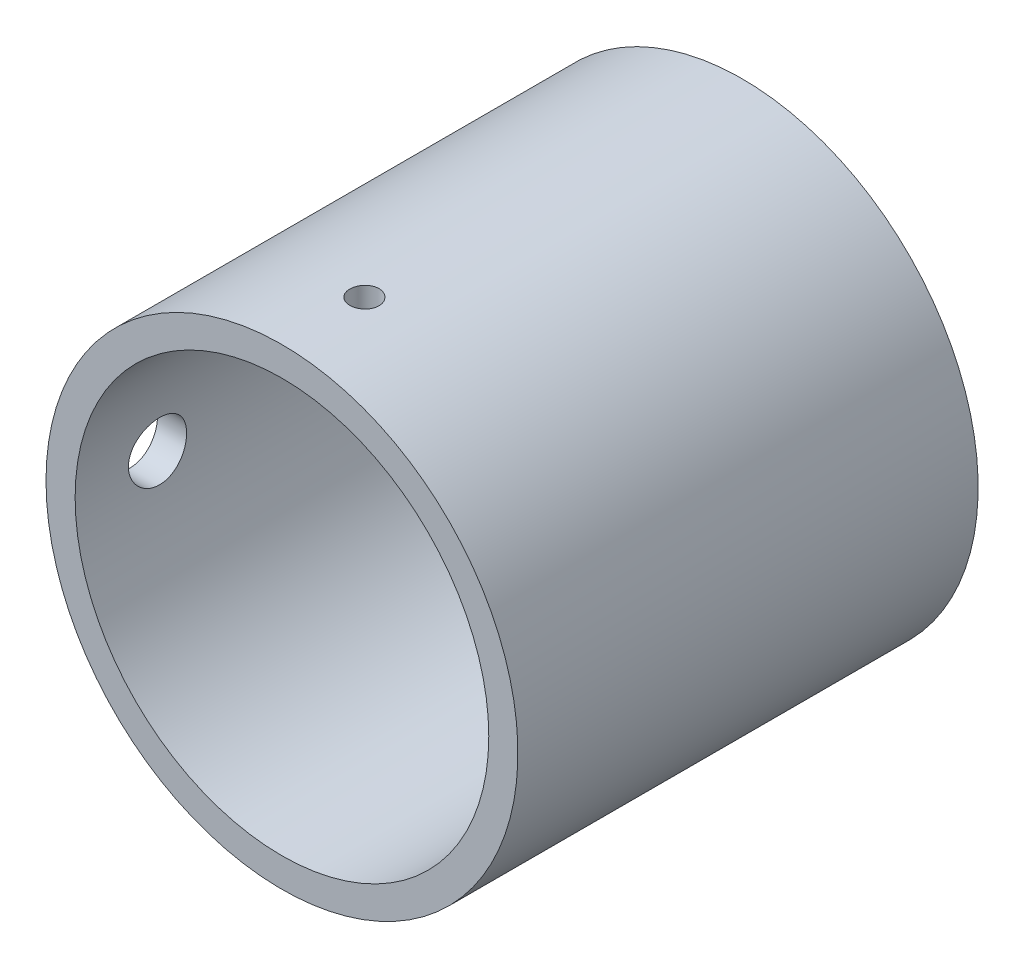
ISO-10303-21;
HEADER;
FILE_DESCRIPTION(('STEP AP214'),'2;1');
FILE_NAME('part.step','',(''),(''),'','','');
FILE_SCHEMA(('AUTOMOTIVE_DESIGN { 1 0 10303 214 1 1 1 1 }'));
ENDSEC;
DATA;
#1=APPLICATION_CONTEXT('core data for automotive mechanical design processes');
#2=APPLICATION_PROTOCOL_DEFINITION('international standard','automotive_design',2000,#1);
#3=PRODUCT_CONTEXT('',#1,'mechanical');
#4=PRODUCT('Part','Part','',(#3));
#5=PRODUCT_RELATED_PRODUCT_CATEGORY('part','',(#4));
#6=PRODUCT_DEFINITION_FORMATION('','',#4);
#7=PRODUCT_DEFINITION_CONTEXT('part definition',#1,'design');
#8=PRODUCT_DEFINITION('design','',#6,#7);
#9=PRODUCT_DEFINITION_SHAPE('','',#8);
#10=(LENGTH_UNIT() NAMED_UNIT(*) SI_UNIT(.MILLI.,.METRE.));
#11=(NAMED_UNIT(*) PLANE_ANGLE_UNIT() SI_UNIT($,.RADIAN.));
#12=(NAMED_UNIT(*) SI_UNIT($,.STERADIAN.) SOLID_ANGLE_UNIT());
#13=UNCERTAINTY_MEASURE_WITH_UNIT(LENGTH_MEASURE(1.E-05),#10,'distance_accuracy_value','');
#14=(GEOMETRIC_REPRESENTATION_CONTEXT(3) GLOBAL_UNCERTAINTY_ASSIGNED_CONTEXT((#13)) GLOBAL_UNIT_ASSIGNED_CONTEXT((#10,
#11,#12)) REPRESENTATION_CONTEXT('',''));
#15=CARTESIAN_POINT('',(0.,0.,0.));
#16=DIRECTION('',(0.,0.,1.));
#17=DIRECTION('',(1.,0.,0.));
#18=AXIS2_PLACEMENT_3D('',#15,#16,#17);
#19=CARTESIAN_POINT('',(0.,0.,24.2977597104441));
#20=DIRECTION('',(0.,0.,-1.));
#21=DIRECTION('',(-1.,0.,0.));
#22=AXIS2_PLACEMENT_3D('',#19,#20,#21);
#23=CYLINDRICAL_SURFACE('',#22,8.1);
#24=CARTESIAN_POINT('',(-8.1,0.,-2.44065146761932));
#25=CARTESIAN_POINT('',(-8.09999922741937,0.05594214674333,-2.44064908756269));
#26=CARTESIAN_POINT('',(-8.09941433539592,0.111919389029058,-2.43594135609883));
#27=CARTESIAN_POINT('',(-8.09713734435104,0.222316609962162,-2.4172353852108));
#28=CARTESIAN_POINT('',(-8.09544408491826,0.276734894056091,-2.40322740862416));
#29=CARTESIAN_POINT('',(-8.09114114001845,0.382399960320262,-2.36633960947191));
#30=CARTESIAN_POINT('',(-8.08853206722158,0.433648835900763,-2.34346571705327));
#31=CARTESIAN_POINT('',(-8.08268778329365,0.531570592610797,-2.28950826455301));
#32=CARTESIAN_POINT('',(-8.07945268075372,0.578244265242838,-2.25842612793311));
#33=CARTESIAN_POINT('',(-8.07269816886397,0.665951461581989,-2.18875581391666));
#34=CARTESIAN_POINT('',(-8.06917746991779,0.706956850183508,-2.15013233901277));
#35=CARTESIAN_POINT('',(-8.06225898575994,0.781921210575562,-2.06655148578826));
#36=CARTESIAN_POINT('',(-8.05886120677906,0.815879825579885,-2.02159378695202));
#37=CARTESIAN_POINT('',(-8.05256054888837,0.875891152826882,-1.92643825588324));
#38=CARTESIAN_POINT('',(-8.04965933020587,0.901917562075163,-1.87622371585767));
#39=CARTESIAN_POINT('',(-8.04469722578763,0.945157707766813,-1.77209483040872));
#40=CARTESIAN_POINT('',(-8.04263630895148,0.962371770370088,-1.71818062200013));
#41=CARTESIAN_POINT('',(-8.03960042916579,0.987413214267985,-1.60847452967584));
#42=CARTESIAN_POINT('',(-8.03861997779846,0.995288051534377,-1.55269363255189));
#43=CARTESIAN_POINT('',(-8.03783922780068,1.00157434170351,-1.4405940449087));
#44=CARTESIAN_POINT('',(-8.0380388828369,0.999986166143075,-1.38427537559016));
#45=CARTESIAN_POINT('',(-8.03959076494516,0.987430479432359,-1.27302940835726));
#46=CARTESIAN_POINT('',(-8.04093657197875,0.976515211775962,-1.21809611174435));
#47=CARTESIAN_POINT('',(-8.04461910501935,0.945696682628199,-1.11084694712858));
#48=CARTESIAN_POINT('',(-8.0469558506526,0.925793243119296,-1.05853113098968));
#49=CARTESIAN_POINT('',(-8.05236425496116,0.877507099359364,-0.957839495876907));
#50=CARTESIAN_POINT('',(-8.0554378796733,0.849101660023145,-0.90947468930058));
#51=CARTESIAN_POINT('',(-8.06197219236468,0.784634111746423,-0.818178633591746));
#52=CARTESIAN_POINT('',(-8.06543289761236,0.74857166114684,-0.775247627054173));
#53=CARTESIAN_POINT('',(-8.07237998032577,0.669524082283407,-0.695734563804384));
#54=CARTESIAN_POINT('',(-8.07586637355702,0.626493916933986,-0.659197266992361));
#55=CARTESIAN_POINT('',(-8.08245015770334,0.534887535004503,-0.593857185030782));
#56=CARTESIAN_POINT('',(-8.08554754775847,0.486311306164644,-0.565054416979187));
#57=CARTESIAN_POINT('',(-8.09100618930941,0.384957418193104,-0.5160010879987));
#58=CARTESIAN_POINT('',(-8.09336720261287,0.332178406522372,-0.49575329355778));
#59=CARTESIAN_POINT('',(-8.09708489187725,0.223933971213345,-0.464420019984365));
#60=CARTESIAN_POINT('',(-8.09844161369651,0.16846867036063,-0.453334122495202));
#61=CARTESIAN_POINT('',(-8.09999189798397,0.0568131699425717,-0.440697259566245));
#62=CARTESIAN_POINT('',(-8.1001929828885,0.00063004990717188,-0.439084627867787));
#63=CARTESIAN_POINT('',(-8.09942963731472,-0.111205648519718,-0.445277387614855));
#64=CARTESIAN_POINT('',(-8.09846523103467,-0.166858237902063,-0.453082583524671));
#65=CARTESIAN_POINT('',(-8.09548396217872,-0.275871415079483,-0.477838213514454));
#66=CARTESIAN_POINT('',(-8.09347047993864,-0.329238772151461,-0.49475928032227));
#67=CARTESIAN_POINT('',(-8.08861651404656,-0.432378270660616,-0.537235816800683));
#68=CARTESIAN_POINT('',(-8.08577600294323,-0.482150292690405,-0.562791573084594));
#69=CARTESIAN_POINT('',(-8.07956598002017,-0.576961912205817,-0.621961505417251));
#70=CARTESIAN_POINT('',(-8.07619387631939,-0.621976416252225,-0.655615613552801));
#71=CARTESIAN_POINT('',(-8.06930608952946,-0.705739989694125,-0.729970388105632));
#72=CARTESIAN_POINT('',(-8.06579040089,-0.744488816600736,-0.770671327117169));
#73=CARTESIAN_POINT('',(-8.05898851395506,-0.814839572602706,-0.858235876435112));
#74=CARTESIAN_POINT('',(-8.05570369730784,-0.846400651747522,-0.905132429173627));
#75=CARTESIAN_POINT('',(-8.04975808813212,-0.901197895148184,-1.00359695157376));
#76=CARTESIAN_POINT('',(-8.04709728335408,-0.924434222825896,-1.05516482950843));
#77=CARTESIAN_POINT('',(-8.04271032507821,-0.961856081742296,-1.16137581097466));
#78=CARTESIAN_POINT('',(-8.04098178598848,-0.976064730842429,-1.21601066654093));
#79=CARTESIAN_POINT('',(-8.0386481910181,-0.995102387633879,-1.32691350005761));
#80=CARTESIAN_POINT('',(-8.03804308425747,-0.999931820107978,-1.38318140393046));
#81=CARTESIAN_POINT('',(-8.03802632219156,-1.0000662905441,-1.49534672015459));
#82=CARTESIAN_POINT('',(-8.03860662533402,-0.995435504469667,-1.55124406523553));
#83=CARTESIAN_POINT('',(-8.04087801825031,-0.976916797222831,-1.66145953084864));
#84=CARTESIAN_POINT('',(-8.04256910823268,-0.963028874312646,-1.71577765108435));
#85=CARTESIAN_POINT('',(-8.04686906175994,-0.926410030686894,-1.82128486242415));
#86=CARTESIAN_POINT('',(-8.04947761276383,-0.903682121110215,-1.87247501213688));
#87=CARTESIAN_POINT('',(-8.05531909495582,-0.85003479092611,-1.97032518905899));
#88=CARTESIAN_POINT('',(-8.05855203320764,-0.819115277645245,-2.01698516500935));
#89=CARTESIAN_POINT('',(-8.06530429843633,-0.749724103367036,-2.10477862375658));
#90=CARTESIAN_POINT('',(-8.06882535219166,-0.711204605816081,-2.14587416669033));
#91=CARTESIAN_POINT('',(-8.07574182689939,-0.627806446454244,-2.22104291828186));
#92=CARTESIAN_POINT('',(-8.07913721800535,-0.582926285977472,-2.25511446732602));
#93=CARTESIAN_POINT('',(-8.08543367524378,-0.487890157300051,-2.31537531255576));
#94=CARTESIAN_POINT('',(-8.08833285956033,-0.437715222782328,-2.34153487883446));
#95=CARTESIAN_POINT('',(-8.09329109884716,-0.333677085780852,-2.38501977836541));
#96=CARTESIAN_POINT('',(-8.09535106854533,-0.279817974196701,-2.40235473544629));
#97=CARTESIAN_POINT('',(-8.09790076769708,-0.188065338859439,-2.42353711493137));
#98=CARTESIAN_POINT('',(-8.09868415585033,-0.150750974329778,-2.42994580448819));
#99=CARTESIAN_POINT('',(-8.09973403133313,-0.07562975183004,-2.43850377023727));
#100=CARTESIAN_POINT('',(-8.10000052234745,-0.0378228973726809,-2.44065307679313));
#101=CARTESIAN_POINT('',(-8.1,0.,-2.44065146761932));
#102=B_SPLINE_CURVE_WITH_KNOTS('',3,(#24,#25,#26,#27,#28,#29,#30,#31,#32,#33,#34,#35,#36,#37,
#38,#39,#40,#41,#42,#43,#44,#45,#46,#47,#48,#49,#50,#51,#52,#53,#54,#55,#56,#57,#58,#59,#60,#61,
#62,#63,#64,#65,#66,#67,#68,#69,#70,#71,#72,#73,#74,#75,#76,#77,#78,#79,#80,#81,#82,#83,#84,#85,
#86,#87,#88,#89,#90,#91,#92,#93,#94,#95,#96,#97,#98,#99,#100,#101),.UNSPECIFIED.,.T.,.F.,(4,2,2,
2,2,2,2,2,2,2,2,2,2,2,2,2,2,2,2,2,2,2,2,2,2,2,2,2,2,2,2,2,2,2,2,2,2,2,4),(0.,0.167688287858711,
0.33555241929854,0.503304464642079,0.671027437753083,0.839555123803084,1.00809134052191,
1.1771804865068,1.34626337376285,1.51448335758694,1.6826967368014,1.84997403887081,
2.01725465413889,2.18498665065476,2.35272613301662,2.52159660867717,2.69046745763993,
2.85939287395638,3.02831057626121,3.19612747897657,3.36394089748794,3.53121690088544,
3.69849845726089,3.86662240092383,4.03475284961943,4.2038162249713,4.37287628128515,
4.54150164904549,4.71011937961965,4.87759704487774,5.04507474157534,5.21249544072306,
5.37991803401936,5.54843013729207,5.7169820107102,5.88615958005681,6.05515225251731,
6.16852834701992,6.28190363330239),.UNSPECIFIED.);
#103=CARTESIAN_POINT('',(-8.1,0.,-2.44065146761932));
#104=VERTEX_POINT('',#103);
#105=EDGE_CURVE('E55',#104,#104,#102,.T.);
#106=ORIENTED_EDGE('',*,*,#105,.T.);
#107=EDGE_LOOP('',(#106));
#108=FACE_BOUND('',#107,.T.);
#109=CARTESIAN_POINT('',(0.,0.,1.3875));
#110=DIRECTION('',(0.,0.,-1.));
#111=DIRECTION('',(-1.,0.,0.));
#112=AXIS2_PLACEMENT_3D('',#109,#110,#111);
#113=CIRCLE('',#112,8.1);
#114=CARTESIAN_POINT('',(-8.1,0.,1.3875));
#115=VERTEX_POINT('',#114);
#116=EDGE_CURVE('E42',#115,#115,#113,.T.);
#117=ORIENTED_EDGE('',*,*,#116,.T.);
#118=EDGE_LOOP('',(#117));
#119=FACE_BOUND('',#118,.T.);
#120=CARTESIAN_POINT('',(0.,0.,-14.4125));
#121=DIRECTION('',(0.,0.,-1.));
#122=DIRECTION('',(-1.,0.,0.));
#123=AXIS2_PLACEMENT_3D('',#120,#121,#122);
#124=CIRCLE('',#123,8.1);
#125=CARTESIAN_POINT('',(-8.1,0.,-14.4125));
#126=VERTEX_POINT('',#125);
#127=EDGE_CURVE('E75',#126,#126,#124,.F.);
#128=ORIENTED_EDGE('',*,*,#127,.T.);
#129=EDGE_LOOP('',(#128));
#130=FACE_BOUND('',#129,.T.);
#131=CARTESIAN_POINT('',(0.,8.1,-1.94065146761932));
#132=CARTESIAN_POINT('',(-0.0280565566641799,8.09999979475951,-1.94065023286848));
#133=CARTESIAN_POINT('',(-0.0561327755197097,8.09985266860309,-1.93828202141509));
#134=CARTESIAN_POINT('',(-0.111510014560206,8.09927989768484,-1.92886872051376));
#135=CARTESIAN_POINT('',(-0.138810093050403,8.09885392848884,-1.92181818303551));
#136=CARTESIAN_POINT('',(-0.191824890167446,8.09777166167511,-1.90324346524688));
#137=CARTESIAN_POINT('',(-0.217540434907588,8.09711548529349,-1.89172163935342));
#138=CARTESIAN_POINT('',(-0.266665768702005,8.09564661238466,-1.86453521030765));
#139=CARTESIAN_POINT('',(-0.290076085231352,8.09483395179005,-1.8488715579122));
#140=CARTESIAN_POINT('',(-0.333967453964497,8.0931421312236,-1.81382094878486));
#141=CARTESIAN_POINT('',(-0.354444686586807,8.09226288677956,-1.79442921274847));
#142=CARTESIAN_POINT('',(-0.391855956922008,8.09053771603672,-1.75248272896546));
#143=CARTESIAN_POINT('',(-0.408789846806787,8.0896917911292,-1.72992784931815));
#144=CARTESIAN_POINT('',(-0.438645445261879,8.08812800720108,-1.6822737826753));
#145=CARTESIAN_POINT('',(-0.451563990546774,8.08741024933882,-1.65717261025487));
#146=CARTESIAN_POINT('',(-0.473001945608588,8.08618483124309,-1.60515241056613));
#147=CARTESIAN_POINT('',(-0.481521401743706,8.08567716879561,-1.57823340245778));
#148=CARTESIAN_POINT('',(-0.493908767333535,8.08492999309712,-1.52337837637618));
#149=CARTESIAN_POINT('',(-0.497782646667117,8.08469013572597,-1.49544371128403));
#150=CARTESIAN_POINT('',(-0.500787321684715,8.084504588182,-1.43931966078546));
#151=CARTESIAN_POINT('',(-0.49991816997583,8.08455889474648,-1.41113027820771));
#152=CARTESIAN_POINT('',(-0.493466410334094,8.0849552314194,-1.35533765781664));
#153=CARTESIAN_POINT('',(-0.487890262046566,8.08529686720932,-1.32773366983118));
#154=CARTESIAN_POINT('',(-0.472192814373869,8.08622874070708,-1.27385425620842));
#155=CARTESIAN_POINT('',(-0.462071488300757,8.08681897987466,-1.24757883837311));
#156=CARTESIAN_POINT('',(-0.437563656276238,8.0881819971168,-1.19708167219224));
#157=CARTESIAN_POINT('',(-0.423174219049295,8.08895490056812,-1.17286135000626));
#158=CARTESIAN_POINT('',(-0.390540753214269,8.09059601855954,-1.12717749386382));
#159=CARTESIAN_POINT('',(-0.37229668237031,8.09146423414394,-1.10571399011843));
#160=CARTESIAN_POINT('',(-0.332435444853554,8.09319988429787,-1.06611545652141));
#161=CARTESIAN_POINT('',(-0.310812687486245,8.09406731513228,-1.04798605381238));
#162=CARTESIAN_POINT('',(-0.264827470445837,8.09570224496201,-1.01561375157049));
#163=CARTESIAN_POINT('',(-0.240465009837291,8.09646974392321,-1.00137085336465));
#164=CARTESIAN_POINT('',(-0.189688542997121,8.09781838247837,-0.977176344708798));
#165=CARTESIAN_POINT('',(-0.16327443549842,8.09839951286611,-0.967224946241626));
#166=CARTESIAN_POINT('',(-0.109145995053428,8.09930980385897,-0.951899674432392));
#167=CARTESIAN_POINT('',(-0.0814316769240631,8.09963896733471,-0.946525748939777));
#168=CARTESIAN_POINT('',(-0.0255383483360696,8.10000786265556,-0.940514939294613));
#169=CARTESIAN_POINT('',(0.00263982242915681,8.10004806986963,-0.939870274883377));
#170=CARTESIAN_POINT('',(0.0587039040170475,8.09983578611,-0.943315960151445));
#171=CARTESIAN_POINT('',(0.0865898163220379,8.09958329662156,-0.947406285803284));
#172=CARTESIAN_POINT('',(0.141255891995393,8.09881435045943,-0.960199399952844));
#173=CARTESIAN_POINT('',(0.168036893567836,8.09829809801379,-0.968898620038975));
#174=CARTESIAN_POINT('',(0.219758800624205,8.09705970907877,-0.990658960144144));
#175=CARTESIAN_POINT('',(0.244699689958617,8.09633757078274,-1.00372011843963));
#176=CARTESIAN_POINT('',(0.292069026788101,8.09476737446074,-1.03385338975742));
#177=CARTESIAN_POINT('',(0.31449416248017,8.09391915379213,-1.05093070031509));
#178=CARTESIAN_POINT('',(0.356162088086153,8.09219280041411,-1.08860394659047));
#179=CARTESIAN_POINT('',(0.375404847411149,8.0913146674173,-1.10919991612557));
#180=CARTESIAN_POINT('',(0.410188132825381,8.08962608621206,-1.15335939626978));
#181=CARTESIAN_POINT('',(0.425723612344726,8.08881573123015,-1.17692688598242));
#182=CARTESIAN_POINT('',(0.452616824293819,8.08735557344742,-1.22634040480514));
#183=CARTESIAN_POINT('',(0.463974581973253,8.08670576967626,-1.25218642014289));
#184=CARTESIAN_POINT('',(0.482181202455226,8.08564066585356,-1.30540486563416));
#185=CARTESIAN_POINT('',(0.489033244367251,8.08522520048877,-1.33277620473763));
#186=CARTESIAN_POINT('',(0.498044312809468,8.08467516709001,-1.38828349002455));
#187=CARTESIAN_POINT('',(0.500203384554458,8.08454059634974,-1.41641942883875));
#188=CARTESIAN_POINT('',(0.49976678949514,8.08456759337792,-1.47260705323665));
#189=CARTESIAN_POINT('',(0.497179057019691,8.08472866697429,-1.50065880105506));
#190=CARTESIAN_POINT('',(0.487338756369365,8.08532775457875,-1.55592868889291));
#191=CARTESIAN_POINT('',(0.480086179708956,8.08576576909061,-1.58314682739589));
#192=CARTESIAN_POINT('',(0.461123839734222,8.08686925737638,-1.63597810135355));
#193=CARTESIAN_POINT('',(0.449414103182236,8.08753472978456,-1.66159124644409));
#194=CARTESIAN_POINT('',(0.421870948142214,8.08901812799941,-1.71048898995974));
#195=CARTESIAN_POINT('',(0.406037637807116,8.08983604980749,-1.73377364943411));
#196=CARTESIAN_POINT('',(0.370667503582555,8.09153376616774,-1.77739365640811));
#197=CARTESIAN_POINT('',(0.351124954995559,8.09241365501954,-1.79772435810112));
#198=CARTESIAN_POINT('',(0.308898560772043,8.09413535822541,-1.8348235163026));
#199=CARTESIAN_POINT('',(0.286213947451571,8.09497716320779,-1.85159109970844));
#200=CARTESIAN_POINT('',(0.238322079466912,8.09652869499997,-1.88110008918034));
#201=CARTESIAN_POINT('',(0.213111785864411,8.09723825968895,-1.89383656646368));
#202=CARTESIAN_POINT('',(0.160924584122798,8.09844316471261,-1.91488040631073));
#203=CARTESIAN_POINT('',(0.133949788071955,8.09893875595707,-1.92319295913859));
#204=CARTESIAN_POINT('',(0.0890081576534832,8.09952991866475,-1.93299114137644));
#205=CARTESIAN_POINT('',(0.0713318634904911,8.09970541632906,-1.93586005237701));
#206=CARTESIAN_POINT('',(0.0357730443091051,8.09994052235547,-1.93969060789058));
#207=CARTESIAN_POINT('',(0.0178905195681911,8.10000013087347,-1.94065225496947));
#208=CARTESIAN_POINT('',(0.,8.1,-1.94065146761932));
#209=B_SPLINE_CURVE_WITH_KNOTS('',3,(#131,#132,#133,#134,#135,#136,#137,#138,#139,#140,#141,
#142,#143,#144,#145,#146,#147,#148,#149,#150,#151,#152,#153,#154,#155,#156,#157,#158,#159,#160,
#161,#162,#163,#164,#165,#166,#167,#168,#169,#170,#171,#172,#173,#174,#175,#176,#177,#178,#179,
#180,#181,#182,#183,#184,#185,#186,#187,#188,#189,#190,#191,#192,#193,#194,#195,#196,#197,#198,
#199,#200,#201,#202,#203,#204,#205,#206,#207,#208),.UNSPECIFIED.,.T.,.F.,(4,2,2,2,2,2,2,2,2,2,2,
2,2,2,2,2,2,2,2,2,2,2,2,2,2,2,2,2,2,2,2,2,2,2,2,2,2,2,4),(0.,0.0841043592410772,
0.168306748341511,0.252464859573429,0.336603669044202,0.420851070302482,0.50510198565835,
0.589419106572033,0.673735338922315,0.75794310272926,0.842149932551775,0.926241388678948,
1.01033333857279,1.09448317582499,1.17863393516911,1.26292544237693,1.34721697836542,
1.43151267754038,1.51580741633258,1.59996344798957,1.68411905260295,1.76820959520941,
1.85230087573815,1.93650158842622,2.0207031104023,2.10501860688043,2.18933359375669,
2.27358902627484,2.35784364702364,2.44195756367534,2.52607163333395,2.61018519795037,
2.6942965566615,2.77853880104912,2.86280166432182,2.94716716025127,3.03143345694245,
3.08506344179977,3.13869335450726),.UNSPECIFIED.);
#210=CARTESIAN_POINT('',(0.,8.1,-1.94065146761932));
#211=VERTEX_POINT('',#210);
#212=EDGE_CURVE('E56',#211,#211,#209,.T.);
#213=ORIENTED_EDGE('',*,*,#212,.F.);
#214=EDGE_LOOP('',(#213));
#215=FACE_BOUND('',#214,.T.);
#216=ADVANCED_FACE('F31',(#108,#119,#130,#215),#23,.T.);
#217=CARTESIAN_POINT('',(0.,0.,24.2977597104441));
#218=DIRECTION('',(0.,0.,-1.));
#219=DIRECTION('',(-1.,0.,0.));
#220=AXIS2_PLACEMENT_3D('',#217,#218,#219);
#221=CYLINDRICAL_SURFACE('',#220,7.1);
#222=CARTESIAN_POINT('',(0.,0.,-14.4125));
#223=DIRECTION('',(0.,0.,-1.));
#224=DIRECTION('',(-1.,0.,0.));
#225=AXIS2_PLACEMENT_3D('',#222,#223,#224);
#226=CIRCLE('',#225,7.1);
#227=CARTESIAN_POINT('',(-7.1,0.,-14.4125));
#228=VERTEX_POINT('',#227);
#229=EDGE_CURVE('E47',#228,#228,#226,.F.);
#230=ORIENTED_EDGE('',*,*,#229,.F.);
#231=EDGE_LOOP('',(#230));
#232=FACE_BOUND('',#231,.T.);
#233=CARTESIAN_POINT('',(0.,0.,1.3875));
#234=DIRECTION('',(0.,0.,-1.));
#235=DIRECTION('',(-1.,0.,0.));
#236=AXIS2_PLACEMENT_3D('',#233,#234,#235);
#237=CIRCLE('',#236,7.1);
#238=CARTESIAN_POINT('',(-7.1,0.,1.3875));
#239=VERTEX_POINT('',#238);
#240=EDGE_CURVE('E10',#239,#239,#237,.T.);
#241=ORIENTED_EDGE('',*,*,#240,.F.);
#242=EDGE_LOOP('',(#241));
#243=FACE_BOUND('',#242,.T.);
#244=CARTESIAN_POINT('',(-7.1,0.,-0.440651467619319));
#245=CARTESIAN_POINT('',(-7.09999914410774,-0.055873833133909,-0.440653800527518));
#246=CARTESIAN_POINT('',(-7.09933351381025,-0.111781054682997,-0.445350097382076));
#247=CARTESIAN_POINT('',(-7.09674222981963,-0.222035508134908,-0.464007982716746));
#248=CARTESIAN_POINT('',(-7.09481531489605,-0.276381121653416,-0.477978845563175));
#249=CARTESIAN_POINT('',(-7.08991821099914,-0.381900580777047,-0.514762413870383));
#250=CARTESIAN_POINT('',(-7.08694877750806,-0.433076691717831,-0.537568717784485));
#251=CARTESIAN_POINT('',(-7.0802955832166,-0.530866886791316,-0.591360747755439));
#252=CARTESIAN_POINT('',(-7.07661193061484,-0.577481660323634,-0.622345235137813));
#253=CARTESIAN_POINT('',(-7.06891205479199,-0.665157181439582,-0.691842890801206));
#254=CARTESIAN_POINT('',(-7.06489391512095,-0.706181785275721,-0.730401449041465));
#255=CARTESIAN_POINT('',(-7.05699310710192,-0.781200793183577,-0.813855090099466));
#256=CARTESIAN_POINT('',(-7.05311044619868,-0.815194811417957,-0.858750520456304));
#257=CARTESIAN_POINT('',(-7.04590153830769,-0.875326146009935,-0.953843404521159));
#258=CARTESIAN_POINT('',(-7.04257776633188,-0.901428902975061,-1.00406291548477));
#259=CARTESIAN_POINT('',(-7.03688883936112,-0.94481596246455,-1.10822773319692));
#260=CARTESIAN_POINT('',(-7.03452363832987,-0.962100688493765,-1.16217286087341));
#261=CARTESIAN_POINT('',(-7.03103831817244,-0.987249673229989,-1.27187924196923));
#262=CARTESIAN_POINT('',(-7.02991006392747,-0.99517551014654,-1.32762611617344));
#263=CARTESIAN_POINT('',(-7.02900162035766,-1.00157241108328,-1.43966919170938));
#264=CARTESIAN_POINT('',(-7.0292213626458,-1.00004395474198,-1.49596536502921));
#265=CARTESIAN_POINT('',(-7.03097664138899,-0.98762606513189,-1.60707627818957));
#266=CARTESIAN_POINT('',(-7.03250257867069,-0.976804921575275,-1.66189882354393));
#267=CARTESIAN_POINT('',(-7.03668332880991,-0.946215594607542,-1.76894218530954));
#268=CARTESIAN_POINT('',(-7.03933817012383,-0.926447185660922,-1.82116293609999));
#269=CARTESIAN_POINT('',(-7.04548830966879,-0.878452540236181,-1.92172981918345));
#270=CARTESIAN_POINT('',(-7.04898650261799,-0.850197088874717,-1.97006182466886));
#271=CARTESIAN_POINT('',(-7.05642704382337,-0.786051268127547,-2.0613242876711));
#272=CARTESIAN_POINT('',(-7.06036941781678,-0.750160456218237,-2.10425443188193));
#273=CARTESIAN_POINT('',(-7.0682966334231,-0.671386471617201,-2.18389055880915));
#274=CARTESIAN_POINT('',(-7.07228154337512,-0.628444526996297,-2.2205384240503));
#275=CARTESIAN_POINT('',(-7.07981251491459,-0.536988339599488,-2.28611562201295));
#276=CARTESIAN_POINT('',(-7.08335857496871,-0.488474077355353,-2.31504492776665));
#277=CARTESIAN_POINT('',(-7.08961539325949,-0.387202171911387,-2.3643656535741));
#278=CARTESIAN_POINT('',(-7.09232574464888,-0.334442477622096,-2.38475291684107));
#279=CARTESIAN_POINT('',(-7.09660226668159,-0.226201696555329,-2.41636201700918));
#280=CARTESIAN_POINT('',(-7.09816850544598,-0.170720772011291,-2.42758439959689));
#281=CARTESIAN_POINT('',(-7.09997137398462,-0.0591143764165711,-2.44046865315766));
#282=CARTESIAN_POINT('',(-7.10021912375047,-0.00299830916813788,-2.4422104849068));
#283=CARTESIAN_POINT('',(-7.09938727430724,0.10872503354572,-2.43629596018259));
#284=CARTESIAN_POINT('',(-7.09830771119853,0.164332322807486,-2.42863985931493));
#285=CARTESIAN_POINT('',(-7.09494942519128,0.273219841227217,-2.40421326921932));
#286=CARTESIAN_POINT('',(-7.0926757868357,0.326508907778513,-2.3874814159991));
#287=CARTESIAN_POINT('',(-7.08718360887496,0.429525164670267,-2.34541879762524));
#288=CARTESIAN_POINT('',(-7.08396502952364,0.479252205075147,-2.32008767076156));
#289=CARTESIAN_POINT('',(-7.07691338683658,0.574086586822433,-2.26135570543931));
#290=CARTESIAN_POINT('',(-7.07307648547793,0.619161984249301,-2.22790375627869));
#291=CARTESIAN_POINT('',(-7.06522810669445,0.703087334422864,-2.15395132377251));
#292=CARTESIAN_POINT('',(-7.06121662038942,0.741936970026659,-2.11345048157249));
#293=CARTESIAN_POINT('',(-7.05343629317507,0.812596158492532,-2.02619537768403));
#294=CARTESIAN_POINT('',(-7.04966943388528,0.844352335946088,-1.97939768945314));
#295=CARTESIAN_POINT('',(-7.04283900274468,0.899553041865819,-1.88108553217356));
#296=CARTESIAN_POINT('',(-7.03977541371267,0.922997773391927,-1.82957117839811));
#297=CARTESIAN_POINT('',(-7.0347124382875,0.96082591560831,-1.72345219173037));
#298=CARTESIAN_POINT('',(-7.03270966547938,0.975238187702199,-1.66885801563993));
#299=CARTESIAN_POINT('',(-7.02998581557498,0.994684606231256,-1.55799402752953));
#300=CARTESIAN_POINT('',(-7.02926466128125,0.999719317518488,-1.5017243166419));
#301=CARTESIAN_POINT('',(-7.02918834593935,1.00025544467278,-1.38963813743399));
#302=CARTESIAN_POINT('',(-7.02982116437172,0.995840751858847,-1.33382206027781));
#303=CARTESIAN_POINT('',(-7.0323554770578,0.977782340549753,-1.2237342315615));
#304=CARTESIAN_POINT('',(-7.03425697019259,0.964138630194175,-1.1694624786394));
#305=CARTESIAN_POINT('',(-7.03911036647693,0.928037844194523,-1.06402243391201));
#306=CARTESIAN_POINT('',(-7.04206165381049,0.905585934703503,-1.01285234320462));
#307=CARTESIAN_POINT('',(-7.04868294663888,0.852514349452175,-0.914991945385801));
#308=CARTESIAN_POINT('',(-7.05235297061081,0.821894463704205,-0.868301753488497));
#309=CARTESIAN_POINT('',(-7.06003711669439,0.753048726549643,-0.780299202058602));
#310=CARTESIAN_POINT('',(-7.06405389333703,0.714760566080494,-0.739035814817523));
#311=CARTESIAN_POINT('',(-7.07195629222062,0.631796537101905,-0.663489257495733));
#312=CARTESIAN_POINT('',(-7.07584188360817,0.587119178678872,-0.629207720063412));
#313=CARTESIAN_POINT('',(-7.08306531837297,0.492393155755627,-0.56845237824623));
#314=CARTESIAN_POINT('',(-7.08640042654625,0.442319599113659,-0.542017070145716));
#315=CARTESIAN_POINT('',(-7.09212005276577,0.338421742080277,-0.497970311270214));
#316=CARTESIAN_POINT('',(-7.09450557361906,0.28460146936132,-0.480349546863063));
#317=CARTESIAN_POINT('',(-7.09750081434408,0.192104071441989,-0.458515421416744));
#318=CARTESIAN_POINT('',(-7.0984332923959,0.154002979429897,-0.451826437083709));
#319=CARTESIAN_POINT('',(-7.0996831780355,0.0772732452815728,-0.442893676351601));
#320=CARTESIAN_POINT('',(-7.10000059196979,0.0386446085929164,-0.440649854085412));
#321=CARTESIAN_POINT('',(-7.1,0.,-0.440651467619319));
#322=B_SPLINE_CURVE_WITH_KNOTS('',3,(#244,#245,#246,#247,#248,#249,#250,#251,#252,#253,#254,
#255,#256,#257,#258,#259,#260,#261,#262,#263,#264,#265,#266,#267,#268,#269,#270,#271,#272,#273,
#274,#275,#276,#277,#278,#279,#280,#281,#282,#283,#284,#285,#286,#287,#288,#289,#290,#291,#292,
#293,#294,#295,#296,#297,#298,#299,#300,#301,#302,#303,#304,#305,#306,#307,#308,#309,#310,#311,
#312,#313,#314,#315,#316,#317,#318,#319,#320,#321),.UNSPECIFIED.,.T.,.F.,(4,2,2,2,2,2,2,2,2,2,2,
2,2,2,2,2,2,2,2,2,2,2,2,2,2,2,2,2,2,2,2,2,2,2,2,2,2,2,4),(0.,0.167480309640034,
0.335128348768238,0.50265514825705,0.670156588543184,0.838694267989499,1.00724119430198,
1.17651591308904,1.34578250132912,1.51392905653943,1.68206708135007,1.84897997196719,
2.01589707022516,2.18339546222098,2.35090356458929,2.51988622648347,2.68886947877712,
2.85793486761062,3.02699018937992,3.19461743099785,3.36224011357835,3.52915475375133,
3.69607641570162,3.86407719950659,4.03208653862295,4.20132041350029,4.3705501534788,
4.53923635945618,4.70791240438686,4.87509716683455,5.04228178183297,5.20936848656143,
5.37645948727794,5.54496771115735,5.71351529417544,5.88287665517676,6.05205868540665,
6.16789605388776,6.28373222710229),.UNSPECIFIED.);
#323=CARTESIAN_POINT('',(-7.1,0.,-0.440651467619319));
#324=VERTEX_POINT('',#323);
#325=EDGE_CURVE('E50',#324,#324,#322,.T.);
#326=ORIENTED_EDGE('',*,*,#325,.F.);
#327=EDGE_LOOP('',(#326));
#328=FACE_BOUND('',#327,.T.);
#329=CARTESIAN_POINT('',(0.,7.1,-1.94065146761932));
#330=CARTESIAN_POINT('',(-0.0280479306741389,7.09999976710711,-1.94065023649306));
#331=CARTESIAN_POINT('',(-0.0561153115539116,7.09983202316728,-1.93828347503045));
#332=CARTESIAN_POINT('',(-0.111474527083796,7.09917898644671,-1.92887626976806));
#333=CARTESIAN_POINT('',(-0.138765429500839,7.09869332748519,-1.92183043638545));
#334=CARTESIAN_POINT('',(-0.191761831152778,7.09745938126122,-1.90326894436104));
#335=CARTESIAN_POINT('',(-0.217468179119438,7.09671123605641,-1.89175570312568));
#336=CARTESIAN_POINT('',(-0.266576929502302,7.09503637769595,-1.86459027836535));
#337=CARTESIAN_POINT('',(-0.289979845851696,7.09410970450988,-1.8489390209851));
#338=CARTESIAN_POINT('',(-0.333867523673767,7.09217996064467,-1.81391011347671));
#339=CARTESIAN_POINT('',(-0.354347416731656,7.09117676668365,-1.7945263699927));
#340=CARTESIAN_POINT('',(-0.391766004620278,7.08920809281411,-1.75259543136597));
#341=CARTESIAN_POINT('',(-0.408704548910027,7.08824261451029,-1.73004810180882));
#342=CARTESIAN_POINT('',(-0.438575282053651,7.08645727261449,-1.68240160112762));
#343=CARTESIAN_POINT('',(-0.451503322119654,7.08563756018598,-1.65729982287902));
#344=CARTESIAN_POINT('',(-0.472959542882921,7.08423782431052,-1.60527520841681));
#345=CARTESIAN_POINT('',(-0.481487781387781,7.08365779771444,-1.57835239613444));
#346=CARTESIAN_POINT('',(-0.493888526951463,7.08280404199194,-1.52349772079528));
#347=CARTESIAN_POINT('',(-0.497768800933497,7.0825298019379,-1.49556762165222));
#348=CARTESIAN_POINT('',(-0.500787453877492,7.08231701711943,-1.43945128866254));
#349=CARTESIAN_POINT('',(-0.499925898758943,7.08237846768832,-1.41126505838202));
#350=CARTESIAN_POINT('',(-0.493491784472118,7.08282966024089,-1.35548959405105));
#351=CARTESIAN_POINT('',(-0.487927642300121,7.08321881567256,-1.32789938363209));
#352=CARTESIAN_POINT('',(-0.472259362471452,7.08428064319456,-1.27404550918065));
#353=CARTESIAN_POINT('',(-0.462155191643543,7.08495331735638,-1.24778185484207));
#354=CARTESIAN_POINT('',(-0.437684164758326,7.08650705662919,-1.19729965346385));
#355=CARTESIAN_POINT('',(-0.42331350502106,7.08738830754872,-1.17308295619196));
#356=CARTESIAN_POINT('',(-0.390720181150664,7.08925971511478,-1.12740231593856));
#357=CARTESIAN_POINT('',(-0.372497461663275,7.09024987332621,-1.10593841252195));
#358=CARTESIAN_POINT('',(-0.332669957050422,7.09223012522552,-1.06632368097601));
#359=CARTESIAN_POINT('',(-0.311057890295973,7.0932202140733,-1.04818017253629));
#360=CARTESIAN_POINT('',(-0.265090662020562,7.0950866914753,-1.01577776475866));
#361=CARTESIAN_POINT('',(-0.240735499278744,7.0959630799789,-1.00151886714965));
#362=CARTESIAN_POINT('',(-0.18996888205835,7.09750350629935,-0.977291001135802));
#363=CARTESIAN_POINT('',(-0.163557287034359,7.09816752958638,-0.967322326247662));
#364=CARTESIAN_POINT('',(-0.109429585376304,7.09920821974143,-0.951962850583035));
#365=CARTESIAN_POINT('',(-0.0817134980834932,7.09958489086848,-0.946571981955561));
#366=CARTESIAN_POINT('',(-0.0258270557796547,7.10000788616611,-0.940530252788571));
#367=CARTESIAN_POINT('',(0.00234220043248656,7.10005491540346,-0.939869275482145));
#368=CARTESIAN_POINT('',(0.0583911624163969,7.09981520578569,-0.94327963424882));
#369=CARTESIAN_POINT('',(0.0862708701064532,7.09952846914322,-0.947350938949888));
#370=CARTESIAN_POINT('',(0.140920713155156,7.09865394919287,-0.960101912723535));
#371=CARTESIAN_POINT('',(0.167691940637302,7.09806647020471,-0.96877692365285));
#372=CARTESIAN_POINT('',(0.219398637531811,7.09665652408025,-0.990484318226303));
#373=CARTESIAN_POINT('',(0.244334086041113,7.09583405426876,-1.00351675147679));
#374=CARTESIAN_POINT('',(0.29170762814517,7.09404470790196,-1.03359468718396));
#375=CARTESIAN_POINT('',(0.314141434536401,7.09307758989761,-1.05064692751892));
#376=CARTESIAN_POINT('',(0.355831679820481,7.09110853502875,-1.08827064549913));
#377=CARTESIAN_POINT('',(0.375088079189004,7.09010659773129,-1.10884216691487));
#378=CARTESIAN_POINT('',(0.409911312994135,7.0881787696352,-1.15296423349462));
#379=CARTESIAN_POINT('',(0.425471570712922,7.08725301627832,-1.17651997614552));
#380=CARTESIAN_POINT('',(0.45241579985601,7.08558416494615,-1.22591579108531));
#381=CARTESIAN_POINT('',(0.463799802627627,7.08484106559985,-1.25175584622616));
#382=CARTESIAN_POINT('',(0.482057046833497,7.08362232388979,-1.30496301515617));
#383=CARTESIAN_POINT('',(0.488934388191193,7.08314643848542,-1.33232871632597));
#384=CARTESIAN_POINT('',(0.497996463075052,7.08251512376268,-1.38782988975547));
#385=CARTESIAN_POINT('',(0.500181258192564,7.08235969023826,-1.41596535190687));
#386=CARTESIAN_POINT('',(0.499795593268327,7.08238691168502,-1.47214200968796));
#387=CARTESIAN_POINT('',(0.497235470100185,7.082568831727,-1.50018327722214));
#388=CARTESIAN_POINT('',(0.487454115786092,7.08324870276629,-1.55543666650143));
#389=CARTESIAN_POINT('',(0.480232876598315,7.08374665430884,-1.58264878681592));
#390=CARTESIAN_POINT('',(0.461336714119417,7.08500229208239,-1.63547265420168));
#391=CARTESIAN_POINT('',(0.44966188843303,7.08575997262114,-1.66108443633162));
#392=CARTESIAN_POINT('',(0.422191254142737,7.08744968853533,-1.70998589041125));
#393=CARTESIAN_POINT('',(0.406395537626353,7.08838172001452,-1.73327561423476));
#394=CARTESIAN_POINT('',(0.371092936428504,7.09031750348339,-1.77692451146734));
#395=CARTESIAN_POINT('',(0.351578488391759,7.09132139898996,-1.79727756124567));
#396=CARTESIAN_POINT('',(0.309404269359494,7.09328651922567,-1.83442646270745));
#397=CARTESIAN_POINT('',(0.28674373300634,7.0942477334963,-1.8512214462914));
#398=CARTESIAN_POINT('',(0.238888677386731,7.09602043060879,-1.8807932919439));
#399=CARTESIAN_POINT('',(0.213690530788161,7.09683169427582,-1.89356429127035));
#400=CARTESIAN_POINT('',(0.161519846833217,7.09821029859103,-1.91467832678786));
#401=CARTESIAN_POINT('',(0.134549415612695,7.09877792293838,-1.92302651566969));
#402=CARTESIAN_POINT('',(0.0895133146301294,7.09945758987448,-1.93290327160979));
#403=CARTESIAN_POINT('',(0.071738270065907,7.09966008210765,-1.93580505189725));
#404=CARTESIAN_POINT('',(0.0359781515774088,7.09993136175162,-1.93967954305372));
#405=CARTESIAN_POINT('',(0.0179930780319255,7.10000014940353,-1.94065225740132));
#406=CARTESIAN_POINT('',(0.,7.1,-1.94065146761932));
#407=B_SPLINE_CURVE_WITH_KNOTS('',3,(#329,#330,#331,#332,#333,#334,#335,#336,#337,#338,#339,
#340,#341,#342,#343,#344,#345,#346,#347,#348,#349,#350,#351,#352,#353,#354,#355,#356,#357,#358,
#359,#360,#361,#362,#363,#364,#365,#366,#367,#368,#369,#370,#371,#372,#373,#374,#375,#376,#377,
#378,#379,#380,#381,#382,#383,#384,#385,#386,#387,#388,#389,#390,#391,#392,#393,#394,#395,#396,
#397,#398,#399,#400,#401,#402,#403,#404,#405,#406),.UNSPECIFIED.,.T.,.F.,(4,2,2,2,2,2,2,2,2,2,2,
2,2,2,2,2,2,2,2,2,2,2,2,2,2,2,2,2,2,2,2,2,2,2,2,2,2,2,4),(0.,0.0840781035428116,
0.168253220704313,0.252382852353498,0.336493670554457,0.420742983630381,0.504995877375079,
0.589335640656747,0.673674295796835,0.757871820389205,0.842068174495733,0.926114146861381,
1.01016073330997,1.09428247552417,1.17840542665353,1.2627116468023,1.347017904473,
1.43132992906165,1.5156407039788,1.59977109248807,1.68390092326929,1.76794579126568,
1.85199161608937,1.93617933040986,2.02036809187723,2.10470555064098,2.18904237634782,
2.27330236993506,2.35756125757297,2.44163680171823,2.52571249091949,2.60978633762509,
2.6938583057347,2.77810312498473,2.86236847473446,2.94675603316183,3.03104506045374,
3.08498225187784,3.13891934603991),.UNSPECIFIED.);
#408=CARTESIAN_POINT('',(0.,7.1,-1.94065146761932));
#409=VERTEX_POINT('',#408);
#410=EDGE_CURVE('E35',#409,#409,#407,.T.);
#411=ORIENTED_EDGE('',*,*,#410,.T.);
#412=EDGE_LOOP('',(#411));
#413=FACE_BOUND('',#412,.T.);
#414=ADVANCED_FACE('F57',(#232,#243,#328,#413),#221,.F.);
#415=CARTESIAN_POINT('',(0.,0.,1.3875));
#416=DIRECTION('',(0.,0.,-1.));
#417=DIRECTION('',(0.,1.,0.));
#418=AXIS2_PLACEMENT_3D('',#415,#416,#417);
#419=PLANE('',#418);
#420=ORIENTED_EDGE('',*,*,#240,.T.);
#421=EDGE_LOOP('',(#420));
#422=FACE_BOUND('',#421,.T.);
#423=ORIENTED_EDGE('',*,*,#116,.F.);
#424=EDGE_LOOP('',(#423));
#425=FACE_BOUND('',#424,.T.);
#426=ADVANCED_FACE('F33',(#422,#425),#419,.F.);
#427=CARTESIAN_POINT('',(0.,0.,-14.4125));
#428=DIRECTION('',(0.,0.,-1.));
#429=DIRECTION('',(8.19092191601677E-13,-1.,0.));
#430=AXIS2_PLACEMENT_3D('',#427,#428,#429);
#431=PLANE('',#430);
#432=ORIENTED_EDGE('',*,*,#127,.F.);
#433=EDGE_LOOP('',(#432));
#434=FACE_BOUND('',#433,.T.);
#435=ORIENTED_EDGE('',*,*,#229,.T.);
#436=EDGE_LOOP('',(#435));
#437=FACE_BOUND('',#436,.T.);
#438=ADVANCED_FACE('F65',(#434,#437),#431,.T.);
#439=CARTESIAN_POINT('',(-8.1,0.,-1.44065146761932));
#440=DIRECTION('',(1.,0.,0.));
#441=DIRECTION('',(0.,0.,-1.));
#442=AXIS2_PLACEMENT_3D('',#439,#440,#441);
#443=CYLINDRICAL_SURFACE('',#442,1.);
#444=ORIENTED_EDGE('',*,*,#325,.T.);
#445=EDGE_LOOP('',(#444));
#446=FACE_BOUND('',#445,.T.);
#447=ORIENTED_EDGE('',*,*,#105,.F.);
#448=EDGE_LOOP('',(#447));
#449=FACE_BOUND('',#448,.T.);
#450=ADVANCED_FACE('F60',(#446,#449),#443,.F.);
#451=CARTESIAN_POINT('',(0.,8.1,-1.44065146761932));
#452=DIRECTION('',(0.,-1.,0.));
#453=DIRECTION('',(0.,0.,-1.));
#454=AXIS2_PLACEMENT_3D('',#451,#452,#453);
#455=CYLINDRICAL_SURFACE('',#454,0.5);
#456=ORIENTED_EDGE('',*,*,#410,.F.);
#457=EDGE_LOOP('',(#456));
#458=FACE_BOUND('',#457,.T.);
#459=ORIENTED_EDGE('',*,*,#212,.T.);
#460=EDGE_LOOP('',(#459));
#461=FACE_BOUND('',#460,.T.);
#462=ADVANCED_FACE('F64',(#458,#461),#455,.F.);
#463=CLOSED_SHELL('',(#216,#414,#426,#438,#450,#462));
#464=MANIFOLD_SOLID_BREP('B2',#463);
#465=ADVANCED_BREP_SHAPE_REPRESENTATION('',(#18,#464),#14);
#466=SHAPE_DEFINITION_REPRESENTATION(#9,#465);
ENDSEC;
END-ISO-10303-21;
